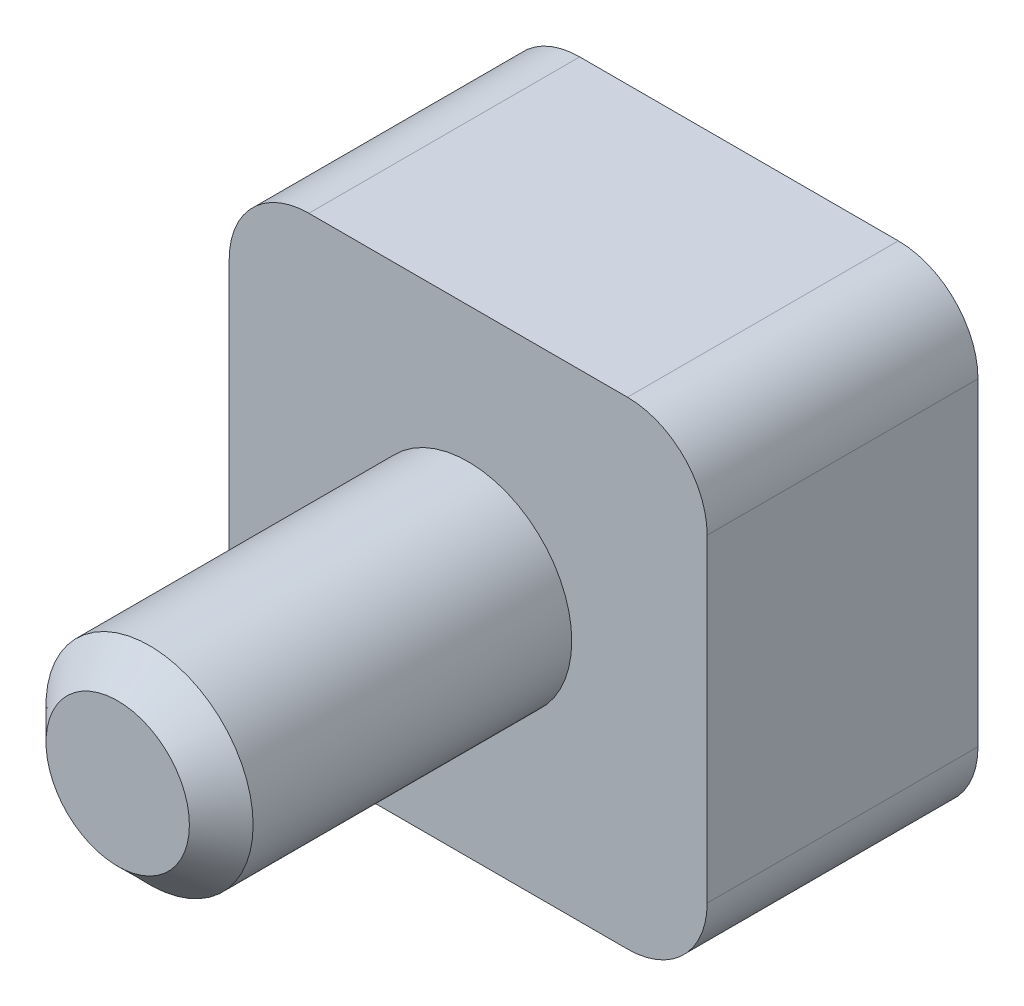
ISO-10303-21;
HEADER;
FILE_DESCRIPTION(('STEP AP214'),'2;1');
FILE_NAME('part.step','',(''),(''),'','','');
FILE_SCHEMA(('AUTOMOTIVE_DESIGN { 1 0 10303 214 1 1 1 1 }'));
ENDSEC;
DATA;
#1=APPLICATION_CONTEXT('core data for automotive mechanical design processes');
#2=APPLICATION_PROTOCOL_DEFINITION('international standard','automotive_design',2000,#1);
#3=PRODUCT_CONTEXT('',#1,'mechanical');
#4=PRODUCT('Part','Part','',(#3));
#5=PRODUCT_RELATED_PRODUCT_CATEGORY('part','',(#4));
#6=PRODUCT_DEFINITION_FORMATION('','',#4);
#7=PRODUCT_DEFINITION_CONTEXT('part definition',#1,'design');
#8=PRODUCT_DEFINITION('design','',#6,#7);
#9=PRODUCT_DEFINITION_SHAPE('','',#8);
#10=(LENGTH_UNIT() NAMED_UNIT(*) SI_UNIT(.MILLI.,.METRE.));
#11=(NAMED_UNIT(*) PLANE_ANGLE_UNIT() SI_UNIT($,.RADIAN.));
#12=(NAMED_UNIT(*) SI_UNIT($,.STERADIAN.) SOLID_ANGLE_UNIT());
#13=UNCERTAINTY_MEASURE_WITH_UNIT(LENGTH_MEASURE(1.E-05),#10,'distance_accuracy_value','');
#14=(GEOMETRIC_REPRESENTATION_CONTEXT(3) GLOBAL_UNCERTAINTY_ASSIGNED_CONTEXT((#13)) GLOBAL_UNIT_ASSIGNED_CONTEXT((#10,
#11,#12)) REPRESENTATION_CONTEXT('',''));
#15=CARTESIAN_POINT('',(0.,0.,0.));
#16=DIRECTION('',(0.,0.,1.));
#17=DIRECTION('',(1.,0.,0.));
#18=AXIS2_PLACEMENT_3D('',#15,#16,#17);
#19=CARTESIAN_POINT('',(-5.,-5.,0.));
#20=DIRECTION('',(0.,0.,-1.));
#21=DIRECTION('',(-1.,0.,0.));
#22=AXIS2_PLACEMENT_3D('',#19,#20,#21);
#23=PLANE('',#22);
#24=CARTESIAN_POINT('',(-5.,-5.,0.));
#25=DIRECTION('',(0.,0.,1.));
#26=DIRECTION('',(-1.,0.,0.));
#27=AXIS2_PLACEMENT_3D('',#24,#25,#26);
#28=CIRCLE('',#27,2.5);
#29=CARTESIAN_POINT('',(-7.5,-4.99999999999999,0.));
#30=VERTEX_POINT('',#29);
#31=CARTESIAN_POINT('',(-4.99999999999998,-7.5,0.));
#32=VERTEX_POINT('',#31);
#33=EDGE_CURVE('E195',#30,#32,#28,.T.);
#34=ORIENTED_EDGE('',*,*,#33,.F.);
#35=DIRECTION('',(0.,-1.,0.));
#36=VECTOR('',#35,1.);
#37=CARTESIAN_POINT('',(-7.5,-4.99999999999999,0.));
#38=LINE('',#37,#36);
#39=CARTESIAN_POINT('',(-7.5,4.99999999999998,0.));
#40=VERTEX_POINT('',#39);
#41=EDGE_CURVE('E351',#40,#30,#38,.T.);
#42=ORIENTED_EDGE('',*,*,#41,.F.);
#43=CARTESIAN_POINT('',(-5.,5.,0.));
#44=DIRECTION('',(0.,0.,1.));
#45=DIRECTION('',(1.,0.,0.));
#46=AXIS2_PLACEMENT_3D('',#43,#44,#45);
#47=CIRCLE('',#46,2.5);
#48=CARTESIAN_POINT('',(-4.99999999999998,7.5,0.));
#49=VERTEX_POINT('',#48);
#50=EDGE_CURVE('E348',#49,#40,#47,.T.);
#51=ORIENTED_EDGE('',*,*,#50,.F.);
#52=DIRECTION('',(-1.,0.,0.));
#53=VECTOR('',#52,1.);
#54=CARTESIAN_POINT('',(4.99999999999998,7.5,0.));
#55=LINE('',#54,#53);
#56=CARTESIAN_POINT('',(4.99999999999998,7.5,0.));
#57=VERTEX_POINT('',#56);
#58=EDGE_CURVE('E345',#57,#49,#55,.T.);
#59=ORIENTED_EDGE('',*,*,#58,.F.);
#60=CARTESIAN_POINT('',(5.,5.,0.));
#61=DIRECTION('',(0.,0.,1.));
#62=DIRECTION('',(1.,0.,0.));
#63=AXIS2_PLACEMENT_3D('',#60,#61,#62);
#64=CIRCLE('',#63,2.5);
#65=CARTESIAN_POINT('',(7.5,4.99999999999998,0.));
#66=VERTEX_POINT('',#65);
#67=EDGE_CURVE('E342',#66,#57,#64,.T.);
#68=ORIENTED_EDGE('',*,*,#67,.F.);
#69=DIRECTION('',(0.,1.,0.));
#70=VECTOR('',#69,1.);
#71=CARTESIAN_POINT('',(7.5,-4.99999999999998,0.));
#72=LINE('',#71,#70);
#73=CARTESIAN_POINT('',(7.5,-5.,0.));
#74=VERTEX_POINT('',#73);
#75=EDGE_CURVE('E339',#74,#66,#72,.T.);
#76=ORIENTED_EDGE('',*,*,#75,.F.);
#77=CARTESIAN_POINT('',(5.,-5.,0.));
#78=DIRECTION('',(0.,0.,1.));
#79=DIRECTION('',(1.,0.,0.));
#80=AXIS2_PLACEMENT_3D('',#77,#78,#79);
#81=CIRCLE('',#80,2.5);
#82=CARTESIAN_POINT('',(4.99999999999998,-7.5,0.));
#83=VERTEX_POINT('',#82);
#84=EDGE_CURVE('E336',#83,#74,#81,.T.);
#85=ORIENTED_EDGE('',*,*,#84,.F.);
#86=DIRECTION('',(1.,0.,0.));
#87=VECTOR('',#86,1.);
#88=CARTESIAN_POINT('',(4.99999999999998,-7.5,0.));
#89=LINE('',#88,#87);
#90=EDGE_CURVE('E333',#32,#83,#89,.T.);
#91=ORIENTED_EDGE('',*,*,#90,.F.);
#92=EDGE_LOOP('',(#34,#42,#51,#59,#68,#76,#85,#91));
#93=FACE_BOUND('',#92,.T.);
#94=CARTESIAN_POINT('',(5.,5.,0.));
#95=DIRECTION('',(0.,0.,-1.));
#96=DIRECTION('',(1.,0.,0.));
#97=AXIS2_PLACEMENT_3D('',#94,#95,#96);
#98=CIRCLE('',#97,1.75);
#99=CARTESIAN_POINT('',(5.,3.25,0.));
#100=VERTEX_POINT('',#99);
#101=CARTESIAN_POINT('',(3.25,5.,0.));
#102=VERTEX_POINT('',#101);
#103=EDGE_CURVE('E297',#100,#102,#98,.T.);
#104=ORIENTED_EDGE('',*,*,#103,.T.);
#105=CARTESIAN_POINT('',(1.75,5.,0.));
#106=DIRECTION('',(0.,0.,-1.));
#107=DIRECTION('',(-1.,0.,0.));
#108=AXIS2_PLACEMENT_3D('',#105,#106,#107);
#109=CIRCLE('',#108,1.5);
#110=CARTESIAN_POINT('',(1.75,6.5,0.));
#111=VERTEX_POINT('',#110);
#112=EDGE_CURVE('E64',#102,#111,#109,.F.);
#113=ORIENTED_EDGE('',*,*,#112,.T.);
#114=DIRECTION('',(-1.,0.,0.));
#115=VECTOR('',#114,1.);
#116=CARTESIAN_POINT('',(3.25,6.5,0.));
#117=LINE('',#116,#115);
#118=CARTESIAN_POINT('',(-4.99999999999998,6.5,0.));
#119=VERTEX_POINT('',#118);
#120=EDGE_CURVE('E246',#111,#119,#117,.T.);
#121=ORIENTED_EDGE('',*,*,#120,.T.);
#122=CARTESIAN_POINT('',(-5.,5.,0.));
#123=DIRECTION('',(0.,0.,1.));
#124=DIRECTION('',(1.,0.,0.));
#125=AXIS2_PLACEMENT_3D('',#122,#123,#124);
#126=CIRCLE('',#125,1.5);
#127=CARTESIAN_POINT('',(-6.5,4.99999999999999,0.));
#128=VERTEX_POINT('',#127);
#129=EDGE_CURVE('E240',#119,#128,#126,.T.);
#130=ORIENTED_EDGE('',*,*,#129,.T.);
#131=DIRECTION('',(0.,-1.,0.));
#132=VECTOR('',#131,1.);
#133=CARTESIAN_POINT('',(-6.5,4.99999999999999,0.));
#134=LINE('',#133,#132);
#135=CARTESIAN_POINT('',(-6.5,-1.75,0.));
#136=VERTEX_POINT('',#135);
#137=EDGE_CURVE('E278',#128,#136,#134,.T.);
#138=ORIENTED_EDGE('',*,*,#137,.T.);
#139=CARTESIAN_POINT('',(-5.,-1.75,0.));
#140=DIRECTION('',(0.,0.,-1.));
#141=DIRECTION('',(-1.,0.,0.));
#142=AXIS2_PLACEMENT_3D('',#139,#140,#141);
#143=CIRCLE('',#142,1.5);
#144=CARTESIAN_POINT('',(-5.,-3.25,0.));
#145=VERTEX_POINT('',#144);
#146=EDGE_CURVE('E393',#136,#145,#143,.F.);
#147=ORIENTED_EDGE('',*,*,#146,.T.);
#148=CARTESIAN_POINT('',(-5.,-5.,0.));
#149=DIRECTION('',(0.,0.,-1.));
#150=DIRECTION('',(1.,0.,0.));
#151=AXIS2_PLACEMENT_3D('',#148,#149,#150);
#152=CIRCLE('',#151,1.75);
#153=CARTESIAN_POINT('',(-3.25,-5.,0.));
#154=VERTEX_POINT('',#153);
#155=EDGE_CURVE('E282',#145,#154,#152,.T.);
#156=ORIENTED_EDGE('',*,*,#155,.T.);
#157=CARTESIAN_POINT('',(-1.75,-5.,0.));
#158=DIRECTION('',(0.,0.,-1.));
#159=DIRECTION('',(-1.,0.,0.));
#160=AXIS2_PLACEMENT_3D('',#157,#158,#159);
#161=CIRCLE('',#160,1.5);
#162=CARTESIAN_POINT('',(-1.75,-6.5,0.));
#163=VERTEX_POINT('',#162);
#164=EDGE_CURVE('E399',#154,#163,#161,.F.);
#165=ORIENTED_EDGE('',*,*,#164,.T.);
#166=DIRECTION('',(1.,0.,0.));
#167=VECTOR('',#166,1.);
#168=CARTESIAN_POINT('',(-3.25,-6.5,0.));
#169=LINE('',#168,#167);
#170=CARTESIAN_POINT('',(4.99999999999998,-6.5,0.));
#171=VERTEX_POINT('',#170);
#172=EDGE_CURVE('E286',#163,#171,#169,.T.);
#173=ORIENTED_EDGE('',*,*,#172,.T.);
#174=CARTESIAN_POINT('',(5.,-5.,0.));
#175=DIRECTION('',(0.,0.,1.));
#176=DIRECTION('',(1.,0.,0.));
#177=AXIS2_PLACEMENT_3D('',#174,#175,#176);
#178=CIRCLE('',#177,1.5);
#179=CARTESIAN_POINT('',(6.5,-4.99999999999999,0.));
#180=VERTEX_POINT('',#179);
#181=EDGE_CURVE('E289',#171,#180,#178,.T.);
#182=ORIENTED_EDGE('',*,*,#181,.T.);
#183=DIRECTION('',(0.,1.,0.));
#184=VECTOR('',#183,1.);
#185=CARTESIAN_POINT('',(6.5,3.25,0.));
#186=LINE('',#185,#184);
#187=CARTESIAN_POINT('',(6.5,1.75,0.));
#188=VERTEX_POINT('',#187);
#189=EDGE_CURVE('E293',#180,#188,#186,.T.);
#190=ORIENTED_EDGE('',*,*,#189,.T.);
#191=CARTESIAN_POINT('',(5.,1.75,0.));
#192=DIRECTION('',(0.,0.,-1.));
#193=DIRECTION('',(-1.,0.,0.));
#194=AXIS2_PLACEMENT_3D('',#191,#192,#193);
#195=CIRCLE('',#194,1.5);
#196=EDGE_CURVE('E72',#188,#100,#195,.F.);
#197=ORIENTED_EDGE('',*,*,#196,.T.);
#198=EDGE_LOOP('',(#104,#113,#121,#130,#138,#147,#156,#165,#173,#182,#190,#197));
#199=FACE_BOUND('',#198,.T.);
#200=ADVANCED_FACE('F47',(#93,#199),#23,.T.);
#201=CARTESIAN_POINT('',(-5.,-5.,3.));
#202=DIRECTION('',(0.,0.,-1.));
#203=DIRECTION('',(-1.,0.,0.));
#204=AXIS2_PLACEMENT_3D('',#201,#202,#203);
#205=CYLINDRICAL_SURFACE('',#204,2.5);
#206=ORIENTED_EDGE('',*,*,#33,.T.);
#207=DIRECTION('',(0.,0.,-1.));
#208=VECTOR('',#207,1.);
#209=CARTESIAN_POINT('',(-4.99999999999998,-7.5,3.));
#210=LINE('',#209,#208);
#211=CARTESIAN_POINT('',(-4.99999999999998,-7.5,8.5));
#212=VERTEX_POINT('',#211);
#213=EDGE_CURVE('E188',#212,#32,#210,.T.);
#214=ORIENTED_EDGE('',*,*,#213,.F.);
#215=CARTESIAN_POINT('',(-5.,-5.,8.5));
#216=DIRECTION('',(0.,0.,1.));
#217=DIRECTION('',(1.,0.,0.));
#218=AXIS2_PLACEMENT_3D('',#215,#216,#217);
#219=CIRCLE('',#218,2.5);
#220=CARTESIAN_POINT('',(-7.5,-4.99999999999999,8.5));
#221=VERTEX_POINT('',#220);
#222=EDGE_CURVE('E193',#221,#212,#219,.T.);
#223=ORIENTED_EDGE('',*,*,#222,.F.);
#224=DIRECTION('',(0.,0.,-1.));
#225=VECTOR('',#224,1.);
#226=CARTESIAN_POINT('',(-7.5,-4.99999999999999,3.));
#227=LINE('',#226,#225);
#228=EDGE_CURVE('E354',#221,#30,#227,.T.);
#229=ORIENTED_EDGE('',*,*,#228,.T.);
#230=EDGE_LOOP('',(#206,#214,#223,#229));
#231=FACE_BOUND('',#230,.T.);
#232=ADVANCED_FACE('F190',(#231),#205,.T.);
#233=CARTESIAN_POINT('',(4.99999999999998,-7.5,3.));
#234=DIRECTION('',(0.,1.,0.));
#235=DIRECTION('',(-1.,0.,0.));
#236=AXIS2_PLACEMENT_3D('',#233,#234,#235);
#237=PLANE('',#236);
#238=ORIENTED_EDGE('',*,*,#90,.T.);
#239=DIRECTION('',(0.,0.,-1.));
#240=VECTOR('',#239,1.);
#241=CARTESIAN_POINT('',(4.99999999999998,-7.5,3.));
#242=LINE('',#241,#240);
#243=CARTESIAN_POINT('',(4.99999999999998,-7.5,8.5));
#244=VERTEX_POINT('',#243);
#245=EDGE_CURVE('E199',#244,#83,#242,.T.);
#246=ORIENTED_EDGE('',*,*,#245,.F.);
#247=DIRECTION('',(1.,0.,0.));
#248=VECTOR('',#247,1.);
#249=CARTESIAN_POINT('',(-4.99999999999998,-7.5,8.5));
#250=LINE('',#249,#248);
#251=EDGE_CURVE('E202',#212,#244,#250,.T.);
#252=ORIENTED_EDGE('',*,*,#251,.F.);
#253=ORIENTED_EDGE('',*,*,#213,.T.);
#254=EDGE_LOOP('',(#238,#246,#252,#253));
#255=FACE_BOUND('',#254,.T.);
#256=ADVANCED_FACE('F203',(#255),#237,.F.);
#257=CARTESIAN_POINT('',(5.,-5.,3.));
#258=DIRECTION('',(0.,0.,-1.));
#259=DIRECTION('',(-1.,0.,0.));
#260=AXIS2_PLACEMENT_3D('',#257,#258,#259);
#261=CYLINDRICAL_SURFACE('',#260,2.5);
#262=ORIENTED_EDGE('',*,*,#84,.T.);
#263=DIRECTION('',(0.,0.,-1.));
#264=VECTOR('',#263,1.);
#265=CARTESIAN_POINT('',(7.5,-5.,3.));
#266=LINE('',#265,#264);
#267=CARTESIAN_POINT('',(7.5,-5.,8.5));
#268=VERTEX_POINT('',#267);
#269=EDGE_CURVE('E373',#268,#74,#266,.T.);
#270=ORIENTED_EDGE('',*,*,#269,.F.);
#271=CARTESIAN_POINT('',(5.,-5.,8.5));
#272=DIRECTION('',(0.,0.,1.));
#273=DIRECTION('',(1.,0.,0.));
#274=AXIS2_PLACEMENT_3D('',#271,#272,#273);
#275=CIRCLE('',#274,2.5);
#276=EDGE_CURVE('E209',#244,#268,#275,.T.);
#277=ORIENTED_EDGE('',*,*,#276,.F.);
#278=ORIENTED_EDGE('',*,*,#245,.T.);
#279=EDGE_LOOP('',(#262,#270,#277,#278));
#280=FACE_BOUND('',#279,.T.);
#281=ADVANCED_FACE('F467',(#280),#261,.T.);
#282=CARTESIAN_POINT('',(7.5,-4.99999999999998,3.));
#283=DIRECTION('',(-1.,0.,0.));
#284=DIRECTION('',(0.,0.,1.));
#285=AXIS2_PLACEMENT_3D('',#282,#283,#284);
#286=PLANE('',#285);
#287=ORIENTED_EDGE('',*,*,#75,.T.);
#288=DIRECTION('',(0.,0.,-1.));
#289=VECTOR('',#288,1.);
#290=CARTESIAN_POINT('',(7.5,4.99999999999998,3.));
#291=LINE('',#290,#289);
#292=CARTESIAN_POINT('',(7.5,4.99999999999998,8.5));
#293=VERTEX_POINT('',#292);
#294=EDGE_CURVE('E369',#293,#66,#291,.T.);
#295=ORIENTED_EDGE('',*,*,#294,.F.);
#296=DIRECTION('',(0.,1.,0.));
#297=VECTOR('',#296,1.);
#298=CARTESIAN_POINT('',(7.5,-5.,8.5));
#299=LINE('',#298,#297);
#300=EDGE_CURVE('E223',#268,#293,#299,.T.);
#301=ORIENTED_EDGE('',*,*,#300,.F.);
#302=ORIENTED_EDGE('',*,*,#269,.T.);
#303=EDGE_LOOP('',(#287,#295,#301,#302));
#304=FACE_BOUND('',#303,.T.);
#305=ADVANCED_FACE('F463',(#304),#286,.F.);
#306=CARTESIAN_POINT('',(5.,5.,3.));
#307=DIRECTION('',(0.,0.,-1.));
#308=DIRECTION('',(-1.,0.,0.));
#309=AXIS2_PLACEMENT_3D('',#306,#307,#308);
#310=CYLINDRICAL_SURFACE('',#309,2.5);
#311=ORIENTED_EDGE('',*,*,#67,.T.);
#312=DIRECTION('',(0.,0.,-1.));
#313=VECTOR('',#312,1.);
#314=CARTESIAN_POINT('',(4.99999999999998,7.5,3.));
#315=LINE('',#314,#313);
#316=CARTESIAN_POINT('',(4.99999999999998,7.5,8.5));
#317=VERTEX_POINT('',#316);
#318=EDGE_CURVE('E365',#317,#57,#315,.T.);
#319=ORIENTED_EDGE('',*,*,#318,.F.);
#320=CARTESIAN_POINT('',(5.,5.,8.5));
#321=DIRECTION('',(0.,0.,1.));
#322=DIRECTION('',(1.,0.,0.));
#323=AXIS2_PLACEMENT_3D('',#320,#321,#322);
#324=CIRCLE('',#323,2.5);
#325=EDGE_CURVE('E227',#293,#317,#324,.T.);
#326=ORIENTED_EDGE('',*,*,#325,.F.);
#327=ORIENTED_EDGE('',*,*,#294,.T.);
#328=EDGE_LOOP('',(#311,#319,#326,#327));
#329=FACE_BOUND('',#328,.T.);
#330=ADVANCED_FACE('F459',(#329),#310,.T.);
#331=CARTESIAN_POINT('',(4.99999999999998,7.5,3.));
#332=DIRECTION('',(0.,-1.,0.));
#333=DIRECTION('',(1.,0.,0.));
#334=AXIS2_PLACEMENT_3D('',#331,#332,#333);
#335=PLANE('',#334);
#336=ORIENTED_EDGE('',*,*,#58,.T.);
#337=DIRECTION('',(0.,0.,-1.));
#338=VECTOR('',#337,1.);
#339=CARTESIAN_POINT('',(-4.99999999999998,7.5,3.));
#340=LINE('',#339,#338);
#341=CARTESIAN_POINT('',(-4.99999999999998,7.5,8.5));
#342=VERTEX_POINT('',#341);
#343=EDGE_CURVE('E361',#342,#49,#340,.T.);
#344=ORIENTED_EDGE('',*,*,#343,.F.);
#345=DIRECTION('',(-1.,0.,0.));
#346=VECTOR('',#345,1.);
#347=CARTESIAN_POINT('',(4.99999999999998,7.5,8.5));
#348=LINE('',#347,#346);
#349=EDGE_CURVE('E231',#317,#342,#348,.T.);
#350=ORIENTED_EDGE('',*,*,#349,.F.);
#351=ORIENTED_EDGE('',*,*,#318,.T.);
#352=EDGE_LOOP('',(#336,#344,#350,#351));
#353=FACE_BOUND('',#352,.T.);
#354=ADVANCED_FACE('F455',(#353),#335,.F.);
#355=CARTESIAN_POINT('',(-5.,5.,3.));
#356=DIRECTION('',(0.,0.,-1.));
#357=DIRECTION('',(-1.,0.,0.));
#358=AXIS2_PLACEMENT_3D('',#355,#356,#357);
#359=CYLINDRICAL_SURFACE('',#358,2.5);
#360=ORIENTED_EDGE('',*,*,#50,.T.);
#361=DIRECTION('',(0.,0.,-1.));
#362=VECTOR('',#361,1.);
#363=CARTESIAN_POINT('',(-7.5,4.99999999999998,3.));
#364=LINE('',#363,#362);
#365=CARTESIAN_POINT('',(-7.5,4.99999999999998,8.5));
#366=VERTEX_POINT('',#365);
#367=EDGE_CURVE('E357',#366,#40,#364,.T.);
#368=ORIENTED_EDGE('',*,*,#367,.F.);
#369=CARTESIAN_POINT('',(-5.,5.,8.5));
#370=DIRECTION('',(0.,0.,1.));
#371=DIRECTION('',(1.,0.,0.));
#372=AXIS2_PLACEMENT_3D('',#369,#370,#371);
#373=CIRCLE('',#372,2.5);
#374=EDGE_CURVE('E235',#342,#366,#373,.T.);
#375=ORIENTED_EDGE('',*,*,#374,.F.);
#376=ORIENTED_EDGE('',*,*,#343,.T.);
#377=EDGE_LOOP('',(#360,#368,#375,#376));
#378=FACE_BOUND('',#377,.T.);
#379=ADVANCED_FACE('F451',(#378),#359,.T.);
#380=CARTESIAN_POINT('',(-7.5,-4.99999999999999,3.));
#381=DIRECTION('',(1.,0.,0.));
#382=DIRECTION('',(0.,0.,-1.));
#383=AXIS2_PLACEMENT_3D('',#380,#381,#382);
#384=PLANE('',#383);
#385=ORIENTED_EDGE('',*,*,#41,.T.);
#386=ORIENTED_EDGE('',*,*,#228,.F.);
#387=DIRECTION('',(0.,-1.,0.));
#388=VECTOR('',#387,1.);
#389=CARTESIAN_POINT('',(-7.5,4.99999999999998,8.5));
#390=LINE('',#389,#388);
#391=EDGE_CURVE('E215',#366,#221,#390,.T.);
#392=ORIENTED_EDGE('',*,*,#391,.F.);
#393=ORIENTED_EDGE('',*,*,#367,.T.);
#394=EDGE_LOOP('',(#385,#386,#392,#393));
#395=FACE_BOUND('',#394,.T.);
#396=ADVANCED_FACE('F448',(#395),#384,.F.);
#397=CARTESIAN_POINT('',(-5.,5.,3.));
#398=DIRECTION('',(0.,0.,-1.));
#399=DIRECTION('',(-1.,0.,0.));
#400=AXIS2_PLACEMENT_3D('',#397,#398,#399);
#401=CYLINDRICAL_SURFACE('',#400,1.5);
#402=ORIENTED_EDGE('',*,*,#129,.F.);
#403=DIRECTION('',(0.,0.,-1.));
#404=VECTOR('',#403,1.);
#405=CARTESIAN_POINT('',(-4.99999999999998,6.5,3.));
#406=LINE('',#405,#404);
#407=CARTESIAN_POINT('',(-4.99999999999998,6.5,3.));
#408=VERTEX_POINT('',#407);
#409=EDGE_CURVE('E274',#408,#119,#406,.T.);
#410=ORIENTED_EDGE('',*,*,#409,.F.);
#411=CARTESIAN_POINT('',(-5.,5.,3.));
#412=DIRECTION('',(0.,0.,1.));
#413=DIRECTION('',(1.,0.,0.));
#414=AXIS2_PLACEMENT_3D('',#411,#412,#413);
#415=CIRCLE('',#414,1.5);
#416=CARTESIAN_POINT('',(-6.5,4.99999999999999,3.));
#417=VERTEX_POINT('',#416);
#418=EDGE_CURVE('E241',#408,#417,#415,.T.);
#419=ORIENTED_EDGE('',*,*,#418,.T.);
#420=DIRECTION('',(0.,0.,-1.));
#421=VECTOR('',#420,1.);
#422=CARTESIAN_POINT('',(-6.5,4.99999999999999,3.));
#423=LINE('',#422,#421);
#424=EDGE_CURVE('E327',#417,#128,#423,.T.);
#425=ORIENTED_EDGE('',*,*,#424,.T.);
#426=EDGE_LOOP('',(#402,#410,#419,#425));
#427=FACE_BOUND('',#426,.T.);
#428=ADVANCED_FACE('F446',(#427),#401,.F.);
#429=CARTESIAN_POINT('',(-6.5,4.99999999999999,3.));
#430=DIRECTION('',(1.,0.,0.));
#431=DIRECTION('',(0.,0.,-1.));
#432=AXIS2_PLACEMENT_3D('',#429,#430,#431);
#433=PLANE('',#432);
#434=DIRECTION('',(0.,-1.,0.));
#435=VECTOR('',#434,1.);
#436=CARTESIAN_POINT('',(-6.5,4.99999999999999,3.));
#437=LINE('',#436,#435);
#438=CARTESIAN_POINT('',(-6.5,-1.75,3.));
#439=VERTEX_POINT('',#438);
#440=EDGE_CURVE('E245',#417,#439,#437,.T.);
#441=ORIENTED_EDGE('',*,*,#440,.T.);
#442=DIRECTION('',(0.,0.,-1.));
#443=VECTOR('',#442,1.);
#444=CARTESIAN_POINT('',(-6.5,-1.75,0.));
#445=LINE('',#444,#443);
#446=EDGE_CURVE('E198',#439,#136,#445,.T.);
#447=ORIENTED_EDGE('',*,*,#446,.T.);
#448=ORIENTED_EDGE('',*,*,#137,.F.);
#449=ORIENTED_EDGE('',*,*,#424,.F.);
#450=EDGE_LOOP('',(#441,#447,#448,#449));
#451=FACE_BOUND('',#450,.T.);
#452=ADVANCED_FACE('F519',(#451),#433,.T.);
#453=CARTESIAN_POINT('',(-5.,-5.,3.));
#454=DIRECTION('',(0.,0.,-1.));
#455=DIRECTION('',(-1.,0.,0.));
#456=AXIS2_PLACEMENT_3D('',#453,#454,#455);
#457=CYLINDRICAL_SURFACE('',#456,1.75);
#458=ORIENTED_EDGE('',*,*,#155,.F.);
#459=DIRECTION('',(0.,0.,-1.));
#460=VECTOR('',#459,1.);
#461=CARTESIAN_POINT('',(-5.,-3.25,3.));
#462=LINE('',#461,#460);
#463=CARTESIAN_POINT('',(-5.,-3.25,3.));
#464=VERTEX_POINT('',#463);
#465=EDGE_CURVE('E323',#464,#145,#462,.T.);
#466=ORIENTED_EDGE('',*,*,#465,.F.);
#467=CARTESIAN_POINT('',(-5.,-5.,3.));
#468=DIRECTION('',(0.,0.,-1.));
#469=DIRECTION('',(1.,0.,0.));
#470=AXIS2_PLACEMENT_3D('',#467,#468,#469);
#471=CIRCLE('',#470,1.75);
#472=CARTESIAN_POINT('',(-3.25,-5.,3.));
#473=VERTEX_POINT('',#472);
#474=EDGE_CURVE('E250',#464,#473,#471,.T.);
#475=ORIENTED_EDGE('',*,*,#474,.T.);
#476=DIRECTION('',(0.,0.,-1.));
#477=VECTOR('',#476,1.);
#478=CARTESIAN_POINT('',(-3.25,-5.,3.));
#479=LINE('',#478,#477);
#480=EDGE_CURVE('E319',#473,#154,#479,.T.);
#481=ORIENTED_EDGE('',*,*,#480,.T.);
#482=EDGE_LOOP('',(#458,#466,#475,#481));
#483=FACE_BOUND('',#482,.T.);
#484=ADVANCED_FACE('F514',(#483),#457,.T.);
#485=CARTESIAN_POINT('',(-3.25,-6.5,3.));
#486=DIRECTION('',(0.,1.,0.));
#487=DIRECTION('',(-1.,0.,0.));
#488=AXIS2_PLACEMENT_3D('',#485,#486,#487);
#489=PLANE('',#488);
#490=ORIENTED_EDGE('',*,*,#172,.F.);
#491=DIRECTION('',(0.,0.,-1.));
#492=VECTOR('',#491,1.);
#493=CARTESIAN_POINT('',(-1.75,-6.5,3.));
#494=LINE('',#493,#492);
#495=CARTESIAN_POINT('',(-1.75,-6.5,3.));
#496=VERTEX_POINT('',#495);
#497=EDGE_CURVE('E382',#163,#496,#494,.F.);
#498=ORIENTED_EDGE('',*,*,#497,.T.);
#499=DIRECTION('',(1.,0.,0.));
#500=VECTOR('',#499,1.);
#501=CARTESIAN_POINT('',(-3.25,-6.5,3.));
#502=LINE('',#501,#500);
#503=CARTESIAN_POINT('',(4.99999999999998,-6.5,3.));
#504=VERTEX_POINT('',#503);
#505=EDGE_CURVE('E254',#496,#504,#502,.T.);
#506=ORIENTED_EDGE('',*,*,#505,.T.);
#507=DIRECTION('',(0.,0.,-1.));
#508=VECTOR('',#507,1.);
#509=CARTESIAN_POINT('',(4.99999999999998,-6.5,3.));
#510=LINE('',#509,#508);
#511=EDGE_CURVE('E315',#504,#171,#510,.T.);
#512=ORIENTED_EDGE('',*,*,#511,.T.);
#513=EDGE_LOOP('',(#490,#498,#506,#512));
#514=FACE_BOUND('',#513,.T.);
#515=ADVANCED_FACE('F507',(#514),#489,.T.);
#516=CARTESIAN_POINT('',(5.,-5.,3.));
#517=DIRECTION('',(0.,0.,-1.));
#518=DIRECTION('',(-1.,0.,0.));
#519=AXIS2_PLACEMENT_3D('',#516,#517,#518);
#520=CYLINDRICAL_SURFACE('',#519,1.5);
#521=ORIENTED_EDGE('',*,*,#181,.F.);
#522=ORIENTED_EDGE('',*,*,#511,.F.);
#523=CARTESIAN_POINT('',(5.,-5.,3.));
#524=DIRECTION('',(0.,0.,1.));
#525=DIRECTION('',(1.,0.,0.));
#526=AXIS2_PLACEMENT_3D('',#523,#524,#525);
#527=CIRCLE('',#526,1.5);
#528=CARTESIAN_POINT('',(6.5,-4.99999999999999,3.));
#529=VERTEX_POINT('',#528);
#530=EDGE_CURVE('E258',#504,#529,#527,.T.);
#531=ORIENTED_EDGE('',*,*,#530,.T.);
#532=DIRECTION('',(0.,0.,-1.));
#533=VECTOR('',#532,1.);
#534=CARTESIAN_POINT('',(6.5,-4.99999999999999,3.));
#535=LINE('',#534,#533);
#536=EDGE_CURVE('E312',#529,#180,#535,.T.);
#537=ORIENTED_EDGE('',*,*,#536,.T.);
#538=EDGE_LOOP('',(#521,#522,#531,#537));
#539=FACE_BOUND('',#538,.T.);
#540=ADVANCED_FACE('F503',(#539),#520,.F.);
#541=CARTESIAN_POINT('',(6.5,3.25,3.));
#542=DIRECTION('',(-1.,0.,0.));
#543=DIRECTION('',(0.,0.,1.));
#544=AXIS2_PLACEMENT_3D('',#541,#542,#543);
#545=PLANE('',#544);
#546=DIRECTION('',(0.,1.,0.));
#547=VECTOR('',#546,1.);
#548=CARTESIAN_POINT('',(6.5,3.25,3.));
#549=LINE('',#548,#547);
#550=CARTESIAN_POINT('',(6.5,1.75,3.));
#551=VERTEX_POINT('',#550);
#552=EDGE_CURVE('E262',#529,#551,#549,.T.);
#553=ORIENTED_EDGE('',*,*,#552,.T.);
#554=DIRECTION('',(0.,0.,-1.));
#555=VECTOR('',#554,1.);
#556=CARTESIAN_POINT('',(6.5,1.75,0.));
#557=LINE('',#556,#555);
#558=EDGE_CURVE('E386',#551,#188,#557,.T.);
#559=ORIENTED_EDGE('',*,*,#558,.T.);
#560=ORIENTED_EDGE('',*,*,#189,.F.);
#561=ORIENTED_EDGE('',*,*,#536,.F.);
#562=EDGE_LOOP('',(#553,#559,#560,#561));
#563=FACE_BOUND('',#562,.T.);
#564=ADVANCED_FACE('F499',(#563),#545,.T.);
#565=CARTESIAN_POINT('',(5.,5.,3.));
#566=DIRECTION('',(0.,0.,-1.));
#567=DIRECTION('',(-1.,0.,0.));
#568=AXIS2_PLACEMENT_3D('',#565,#566,#567);
#569=CYLINDRICAL_SURFACE('',#568,1.75);
#570=ORIENTED_EDGE('',*,*,#103,.F.);
#571=DIRECTION('',(0.,0.,-1.));
#572=VECTOR('',#571,1.);
#573=CARTESIAN_POINT('',(5.,3.25,3.));
#574=LINE('',#573,#572);
#575=CARTESIAN_POINT('',(5.,3.25,3.));
#576=VERTEX_POINT('',#575);
#577=EDGE_CURVE('E309',#576,#100,#574,.T.);
#578=ORIENTED_EDGE('',*,*,#577,.F.);
#579=CARTESIAN_POINT('',(5.,5.,3.));
#580=DIRECTION('',(0.,0.,-1.));
#581=DIRECTION('',(1.,0.,0.));
#582=AXIS2_PLACEMENT_3D('',#579,#580,#581);
#583=CIRCLE('',#582,1.75);
#584=CARTESIAN_POINT('',(3.25,5.,3.));
#585=VERTEX_POINT('',#584);
#586=EDGE_CURVE('E266',#576,#585,#583,.T.);
#587=ORIENTED_EDGE('',*,*,#586,.T.);
#588=DIRECTION('',(0.,0.,-1.));
#589=VECTOR('',#588,1.);
#590=CARTESIAN_POINT('',(3.25,5.,3.));
#591=LINE('',#590,#589);
#592=EDGE_CURVE('E305',#585,#102,#591,.T.);
#593=ORIENTED_EDGE('',*,*,#592,.T.);
#594=EDGE_LOOP('',(#570,#578,#587,#593));
#595=FACE_BOUND('',#594,.T.);
#596=ADVANCED_FACE('F495',(#595),#569,.T.);
#597=CARTESIAN_POINT('',(3.25,6.5,3.));
#598=DIRECTION('',(0.,-1.,0.));
#599=DIRECTION('',(0.,0.,-1.));
#600=AXIS2_PLACEMENT_3D('',#597,#598,#599);
#601=PLANE('',#600);
#602=ORIENTED_EDGE('',*,*,#120,.F.);
#603=DIRECTION('',(0.,0.,-1.));
#604=VECTOR('',#603,1.);
#605=CARTESIAN_POINT('',(1.75,6.5,3.));
#606=LINE('',#605,#604);
#607=CARTESIAN_POINT('',(1.75,6.5,3.));
#608=VERTEX_POINT('',#607);
#609=EDGE_CURVE('E389',#111,#608,#606,.F.);
#610=ORIENTED_EDGE('',*,*,#609,.T.);
#611=DIRECTION('',(-1.,0.,0.));
#612=VECTOR('',#611,1.);
#613=CARTESIAN_POINT('',(3.25,6.5,3.));
#614=LINE('',#613,#612);
#615=EDGE_CURVE('E270',#608,#408,#614,.T.);
#616=ORIENTED_EDGE('',*,*,#615,.T.);
#617=ORIENTED_EDGE('',*,*,#409,.T.);
#618=EDGE_LOOP('',(#602,#610,#616,#617));
#619=FACE_BOUND('',#618,.T.);
#620=ADVANCED_FACE('F478',(#619),#601,.T.);
#621=CARTESIAN_POINT('',(-5.,-1.75,3.));
#622=DIRECTION('',(0.,0.,1.));
#623=DIRECTION('',(1.,0.,0.));
#624=AXIS2_PLACEMENT_3D('',#621,#622,#623);
#625=CYLINDRICAL_SURFACE('',#624,1.5);
#626=CARTESIAN_POINT('',(-5.,-1.75,3.));
#627=DIRECTION('',(0.,0.,-1.));
#628=DIRECTION('',(-1.,0.,0.));
#629=AXIS2_PLACEMENT_3D('',#626,#627,#628);
#630=CIRCLE('',#629,1.5);
#631=EDGE_CURVE('E396',#464,#439,#630,.T.);
#632=ORIENTED_EDGE('',*,*,#631,.F.);
#633=ORIENTED_EDGE('',*,*,#465,.T.);
#634=ORIENTED_EDGE('',*,*,#146,.F.);
#635=ORIENTED_EDGE('',*,*,#446,.F.);
#636=EDGE_LOOP('',(#632,#633,#634,#635));
#637=FACE_BOUND('',#636,.T.);
#638=ADVANCED_FACE('F474',(#637),#625,.F.);
#639=CARTESIAN_POINT('',(-1.75,-5.,3.));
#640=DIRECTION('',(0.,0.,1.));
#641=DIRECTION('',(1.,0.,0.));
#642=AXIS2_PLACEMENT_3D('',#639,#640,#641);
#643=CYLINDRICAL_SURFACE('',#642,1.5);
#644=CARTESIAN_POINT('',(-1.75,-5.,3.));
#645=DIRECTION('',(0.,0.,-1.));
#646=DIRECTION('',(-1.,0.,0.));
#647=AXIS2_PLACEMENT_3D('',#644,#645,#646);
#648=CIRCLE('',#647,1.5);
#649=EDGE_CURVE('E402',#496,#473,#648,.T.);
#650=ORIENTED_EDGE('',*,*,#649,.F.);
#651=ORIENTED_EDGE('',*,*,#497,.F.);
#652=ORIENTED_EDGE('',*,*,#164,.F.);
#653=ORIENTED_EDGE('',*,*,#480,.F.);
#654=EDGE_LOOP('',(#650,#651,#652,#653));
#655=FACE_BOUND('',#654,.T.);
#656=ADVANCED_FACE('F477',(#655),#643,.F.);
#657=CARTESIAN_POINT('',(5.,1.75,3.));
#658=DIRECTION('',(0.,0.,1.));
#659=DIRECTION('',(1.,0.,0.));
#660=AXIS2_PLACEMENT_3D('',#657,#658,#659);
#661=CYLINDRICAL_SURFACE('',#660,1.5);
#662=CARTESIAN_POINT('',(5.,1.75,3.));
#663=DIRECTION('',(0.,0.,-1.));
#664=DIRECTION('',(-1.,0.,0.));
#665=AXIS2_PLACEMENT_3D('',#662,#663,#664);
#666=CIRCLE('',#665,1.5);
#667=EDGE_CURVE('E407',#576,#551,#666,.T.);
#668=ORIENTED_EDGE('',*,*,#667,.F.);
#669=ORIENTED_EDGE('',*,*,#577,.T.);
#670=ORIENTED_EDGE('',*,*,#196,.F.);
#671=ORIENTED_EDGE('',*,*,#558,.F.);
#672=EDGE_LOOP('',(#668,#669,#670,#671));
#673=FACE_BOUND('',#672,.T.);
#674=ADVANCED_FACE('F482',(#673),#661,.F.);
#675=CARTESIAN_POINT('',(1.75,5.,3.));
#676=DIRECTION('',(0.,0.,1.));
#677=DIRECTION('',(1.,0.,0.));
#678=AXIS2_PLACEMENT_3D('',#675,#676,#677);
#679=CYLINDRICAL_SURFACE('',#678,1.5);
#680=CARTESIAN_POINT('',(1.75,5.,3.));
#681=DIRECTION('',(0.,0.,-1.));
#682=DIRECTION('',(-1.,0.,0.));
#683=AXIS2_PLACEMENT_3D('',#680,#681,#682);
#684=CIRCLE('',#683,1.5);
#685=EDGE_CURVE('E412',#608,#585,#684,.T.);
#686=ORIENTED_EDGE('',*,*,#685,.F.);
#687=ORIENTED_EDGE('',*,*,#609,.F.);
#688=ORIENTED_EDGE('',*,*,#112,.F.);
#689=ORIENTED_EDGE('',*,*,#592,.F.);
#690=EDGE_LOOP('',(#686,#687,#688,#689));
#691=FACE_BOUND('',#690,.T.);
#692=ADVANCED_FACE('F434',(#691),#679,.F.);
#693=CARTESIAN_POINT('',(-5.,-5.,3.));
#694=DIRECTION('',(0.,0.,1.));
#695=DIRECTION('',(1.,0.,0.));
#696=AXIS2_PLACEMENT_3D('',#693,#694,#695);
#697=PLANE('',#696);
#698=ORIENTED_EDGE('',*,*,#418,.F.);
#699=ORIENTED_EDGE('',*,*,#615,.F.);
#700=ORIENTED_EDGE('',*,*,#685,.T.);
#701=ORIENTED_EDGE('',*,*,#586,.F.);
#702=ORIENTED_EDGE('',*,*,#667,.T.);
#703=ORIENTED_EDGE('',*,*,#552,.F.);
#704=ORIENTED_EDGE('',*,*,#530,.F.);
#705=ORIENTED_EDGE('',*,*,#505,.F.);
#706=ORIENTED_EDGE('',*,*,#649,.T.);
#707=ORIENTED_EDGE('',*,*,#474,.F.);
#708=ORIENTED_EDGE('',*,*,#631,.T.);
#709=ORIENTED_EDGE('',*,*,#440,.F.);
#710=EDGE_LOOP('',(#698,#699,#700,#701,#702,#703,#704,#705,#706,#707,#708,#709));
#711=FACE_BOUND('',#710,.T.);
#712=ADVANCED_FACE('F425',(#711),#697,.F.);
#713=CARTESIAN_POINT('',(-5.,-5.,8.5));
#714=DIRECTION('',(0.,0.,1.));
#715=DIRECTION('',(1.,0.,0.));
#716=AXIS2_PLACEMENT_3D('',#713,#714,#715);
#717=PLANE('',#716);
#718=CARTESIAN_POINT('',(0.,0.,8.5));
#719=DIRECTION('',(0.,0.,1.));
#720=DIRECTION('',(1.,0.,0.));
#721=AXIS2_PLACEMENT_3D('',#718,#719,#720);
#722=CIRCLE('',#721,3.25);
#723=CARTESIAN_POINT('',(3.25,0.,8.5));
#724=VERTEX_POINT('',#723);
#725=EDGE_CURVE('E219',#724,#724,#722,.T.);
#726=ORIENTED_EDGE('',*,*,#725,.F.);
#727=EDGE_LOOP('',(#726));
#728=FACE_BOUND('',#727,.T.);
#729=ORIENTED_EDGE('',*,*,#222,.T.);
#730=ORIENTED_EDGE('',*,*,#251,.T.);
#731=ORIENTED_EDGE('',*,*,#276,.T.);
#732=ORIENTED_EDGE('',*,*,#300,.T.);
#733=ORIENTED_EDGE('',*,*,#325,.T.);
#734=ORIENTED_EDGE('',*,*,#349,.T.);
#735=ORIENTED_EDGE('',*,*,#374,.T.);
#736=ORIENTED_EDGE('',*,*,#391,.T.);
#737=EDGE_LOOP('',(#729,#730,#731,#732,#733,#734,#735,#736));
#738=FACE_BOUND('',#737,.T.);
#739=ADVANCED_FACE('F212',(#728,#738),#717,.T.);
#740=CARTESIAN_POINT('',(0.,0.,19.5));
#741=DIRECTION('',(0.,0.,-1.));
#742=DIRECTION('',(-1.,0.,0.));
#743=AXIS2_PLACEMENT_3D('',#740,#741,#742);
#744=CYLINDRICAL_SURFACE('',#743,3.25);
#745=CARTESIAN_POINT('',(0.,0.,18.5));
#746=DIRECTION('',(0.,0.,1.));
#747=DIRECTION('',(1.,0.,0.));
#748=AXIS2_PLACEMENT_3D('',#745,#746,#747);
#749=CIRCLE('',#748,3.25);
#750=CARTESIAN_POINT('',(3.25,0.,18.5));
#751=VERTEX_POINT('',#750);
#752=EDGE_CURVE('E11',#751,#751,#749,.F.);
#753=ORIENTED_EDGE('',*,*,#752,.T.);
#754=EDGE_LOOP('',(#753));
#755=FACE_BOUND('',#754,.T.);
#756=ORIENTED_EDGE('',*,*,#725,.T.);
#757=EDGE_LOOP('',(#756));
#758=FACE_BOUND('',#757,.T.);
#759=ADVANCED_FACE('F422',(#755,#758),#744,.T.);
#760=CARTESIAN_POINT('',(0.,0.,19.5));
#761=DIRECTION('',(0.,0.,1.));
#762=DIRECTION('',(1.,0.,0.));
#763=AXIS2_PLACEMENT_3D('',#760,#761,#762);
#764=PLANE('',#763);
#765=CARTESIAN_POINT('',(0.,0.,19.5));
#766=DIRECTION('',(0.,0.,1.));
#767=DIRECTION('',(1.,0.,0.));
#768=AXIS2_PLACEMENT_3D('',#765,#766,#767);
#769=CIRCLE('',#768,2.25);
#770=CARTESIAN_POINT('',(2.25,0.,19.5));
#771=VERTEX_POINT('',#770);
#772=EDGE_CURVE('E57',#771,#771,#769,.T.);
#773=ORIENTED_EDGE('',*,*,#772,.T.);
#774=EDGE_LOOP('',(#773));
#775=FACE_BOUND('',#774,.T.);
#776=ADVANCED_FACE('F431',(#775),#764,.T.);
#777=CARTESIAN_POINT('',(0.,0.,19.5));
#778=DIRECTION('',(0.,0.,-1.));
#779=DIRECTION('',(-1.,0.,0.));
#780=AXIS2_PLACEMENT_3D('',#777,#778,#779);
#781=CONICAL_SURFACE('',#780,2.25,0.785398163397449);
#782=ORIENTED_EDGE('',*,*,#752,.F.);
#783=EDGE_LOOP('',(#782));
#784=FACE_BOUND('',#783,.T.);
#785=ORIENTED_EDGE('',*,*,#772,.F.);
#786=EDGE_LOOP('',(#785));
#787=FACE_BOUND('',#786,.T.);
#788=ADVANCED_FACE('F50',(#784,#787),#781,.T.);
#789=CLOSED_SHELL('',(#200,#232,#256,#281,#305,#330,#354,#379,#396,#428,#452,#484,#515,#540,
#564,#596,#620,#638,#656,#674,#692,#712,#739,#759,#776,#788));
#790=MANIFOLD_SOLID_BREP('B2',#789);
#791=ADVANCED_BREP_SHAPE_REPRESENTATION('',(#18,#790),#14);
#792=SHAPE_DEFINITION_REPRESENTATION(#9,#791);
ENDSEC;
END-ISO-10303-21;
